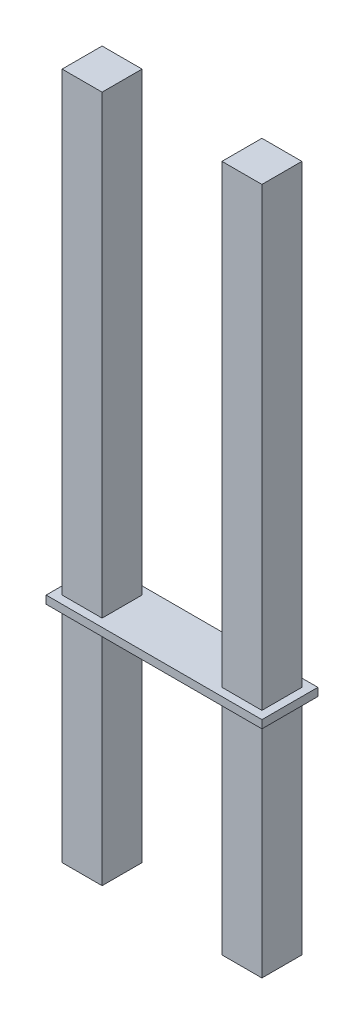
ISO-10303-21;
HEADER;
FILE_DESCRIPTION(('STEP AP214'),'2;1');
FILE_NAME('part.step','',(''),(''),'','','');
FILE_SCHEMA(('AUTOMOTIVE_DESIGN { 1 0 10303 214 1 1 1 1 }'));
ENDSEC;
DATA;
#1=APPLICATION_CONTEXT('core data for automotive mechanical design processes');
#2=APPLICATION_PROTOCOL_DEFINITION('international standard','automotive_design',2000,#1);
#3=PRODUCT_CONTEXT('',#1,'mechanical');
#4=PRODUCT('Part','Part','',(#3));
#5=PRODUCT_RELATED_PRODUCT_CATEGORY('part','',(#4));
#6=PRODUCT_DEFINITION_FORMATION('','',#4);
#7=PRODUCT_DEFINITION_CONTEXT('part definition',#1,'design');
#8=PRODUCT_DEFINITION('design','',#6,#7);
#9=PRODUCT_DEFINITION_SHAPE('','',#8);
#10=(LENGTH_UNIT() NAMED_UNIT(*) SI_UNIT(.MILLI.,.METRE.));
#11=(NAMED_UNIT(*) PLANE_ANGLE_UNIT() SI_UNIT($,.RADIAN.));
#12=(NAMED_UNIT(*) SI_UNIT($,.STERADIAN.) SOLID_ANGLE_UNIT());
#13=UNCERTAINTY_MEASURE_WITH_UNIT(LENGTH_MEASURE(1.E-05),#10,'distance_accuracy_value','');
#14=(GEOMETRIC_REPRESENTATION_CONTEXT(3) GLOBAL_UNCERTAINTY_ASSIGNED_CONTEXT((#13)) GLOBAL_UNIT_ASSIGNED_CONTEXT((#10,
#11,#12)) REPRESENTATION_CONTEXT('',''));
#15=CARTESIAN_POINT('',(0.,0.,0.));
#16=DIRECTION('',(0.,0.,1.));
#17=DIRECTION('',(1.,0.,0.));
#18=AXIS2_PLACEMENT_3D('',#15,#16,#17);
#19=CARTESIAN_POINT('',(0.,0.,-0.3175));
#20=DIRECTION('',(0.,0.,1.));
#21=DIRECTION('',(1.,0.,0.));
#22=AXIS2_PLACEMENT_3D('',#19,#20,#21);
#23=PLANE('',#22);
#24=DIRECTION('',(0.,-1.,0.));
#25=VECTOR('',#24,1.);
#26=CARTESIAN_POINT('',(0.9525,0.,-0.3175));
#27=LINE('',#26,#25);
#28=CARTESIAN_POINT('',(0.9525,3.556,-0.3175));
#29=VERTEX_POINT('',#28);
#30=CARTESIAN_POINT('',(0.9525,0.,-0.3175));
#31=VERTEX_POINT('',#30);
#32=EDGE_CURVE('E10',#29,#31,#27,.T.);
#33=ORIENTED_EDGE('',*,*,#32,.F.);
#34=DIRECTION('',(-1.,0.,0.));
#35=VECTOR('',#34,1.);
#36=CARTESIAN_POINT('',(0.,3.556,-0.3175));
#37=LINE('',#36,#35);
#38=CARTESIAN_POINT('',(1.5875,3.556,-0.3175));
#39=VERTEX_POINT('',#38);
#40=EDGE_CURVE('E24',#39,#29,#37,.T.);
#41=ORIENTED_EDGE('',*,*,#40,.F.);
#42=DIRECTION('',(0.,1.,0.));
#43=VECTOR('',#42,1.);
#44=CARTESIAN_POINT('',(1.5875,0.,-0.3175));
#45=LINE('',#44,#43);
#46=CARTESIAN_POINT('',(1.5875,0.,-0.3175));
#47=VERTEX_POINT('',#46);
#48=EDGE_CURVE('E421',#47,#39,#45,.T.);
#49=ORIENTED_EDGE('',*,*,#48,.F.);
#50=DIRECTION('',(1.,0.,0.));
#51=VECTOR('',#50,1.);
#52=CARTESIAN_POINT('',(-1.5875,0.,-0.3175));
#53=LINE('',#52,#51);
#54=EDGE_CURVE('E416',#31,#47,#53,.T.);
#55=ORIENTED_EDGE('',*,*,#54,.F.);
#56=EDGE_LOOP('',(#33,#41,#49,#55));
#57=FACE_BOUND('',#56,.T.);
#58=ADVANCED_FACE('F16',(#57),#23,.F.);
#59=CARTESIAN_POINT('',(-1.5875,0.,0.3175));
#60=DIRECTION('',(0.,1.,0.));
#61=DIRECTION('',(0.,0.,1.));
#62=AXIS2_PLACEMENT_3D('',#59,#60,#61);
#63=PLANE('',#62);
#64=DIRECTION('',(0.,0.,1.));
#65=VECTOR('',#64,1.);
#66=CARTESIAN_POINT('',(0.9525,0.,0.3175));
#67=LINE('',#66,#65);
#68=CARTESIAN_POINT('',(0.9525,0.,0.3175));
#69=VERTEX_POINT('',#68);
#70=EDGE_CURVE('E411',#31,#69,#67,.T.);
#71=ORIENTED_EDGE('',*,*,#70,.F.);
#72=ORIENTED_EDGE('',*,*,#54,.T.);
#73=DIRECTION('',(0.,0.,-1.));
#74=VECTOR('',#73,1.);
#75=CARTESIAN_POINT('',(1.5875,0.,0.3175));
#76=LINE('',#75,#74);
#77=CARTESIAN_POINT('',(1.5875,0.,0.3175));
#78=VERTEX_POINT('',#77);
#79=EDGE_CURVE('E406',#78,#47,#76,.T.);
#80=ORIENTED_EDGE('',*,*,#79,.F.);
#81=DIRECTION('',(1.,0.,0.));
#82=VECTOR('',#81,1.);
#83=CARTESIAN_POINT('',(-1.5875,0.,0.3175));
#84=LINE('',#83,#82);
#85=EDGE_CURVE('E401',#69,#78,#84,.T.);
#86=ORIENTED_EDGE('',*,*,#85,.F.);
#87=EDGE_LOOP('',(#71,#72,#80,#86));
#88=FACE_BOUND('',#87,.T.);
#89=ADVANCED_FACE('F445',(#88),#63,.F.);
#90=CARTESIAN_POINT('',(0.,0.,0.3175));
#91=DIRECTION('',(0.,0.,1.));
#92=DIRECTION('',(1.,0.,0.));
#93=AXIS2_PLACEMENT_3D('',#90,#91,#92);
#94=PLANE('',#93);
#95=DIRECTION('',(-1.,0.,0.));
#96=VECTOR('',#95,1.);
#97=CARTESIAN_POINT('',(0.,3.556,0.3175));
#98=LINE('',#97,#96);
#99=CARTESIAN_POINT('',(1.5875,3.556,0.3175));
#100=VERTEX_POINT('',#99);
#101=CARTESIAN_POINT('',(0.9525,3.556,0.3175));
#102=VERTEX_POINT('',#101);
#103=EDGE_CURVE('E397',#100,#102,#98,.T.);
#104=ORIENTED_EDGE('',*,*,#103,.T.);
#105=DIRECTION('',(0.,-1.,0.));
#106=VECTOR('',#105,1.);
#107=CARTESIAN_POINT('',(0.9525,0.,0.3175));
#108=LINE('',#107,#106);
#109=EDGE_CURVE('E392',#102,#69,#108,.T.);
#110=ORIENTED_EDGE('',*,*,#109,.T.);
#111=ORIENTED_EDGE('',*,*,#85,.T.);
#112=DIRECTION('',(0.,1.,0.));
#113=VECTOR('',#112,1.);
#114=CARTESIAN_POINT('',(1.5875,0.,0.3175));
#115=LINE('',#114,#113);
#116=EDGE_CURVE('E388',#78,#100,#115,.T.);
#117=ORIENTED_EDGE('',*,*,#116,.T.);
#118=EDGE_LOOP('',(#104,#110,#111,#117));
#119=FACE_BOUND('',#118,.T.);
#120=ADVANCED_FACE('F440',(#119),#94,.T.);
#121=CARTESIAN_POINT('',(1.5875,0.,0.3175));
#122=DIRECTION('',(-1.,0.,0.));
#123=DIRECTION('',(0.,0.,1.));
#124=AXIS2_PLACEMENT_3D('',#121,#122,#123);
#125=PLANE('',#124);
#126=DIRECTION('',(0.,0.,-1.));
#127=VECTOR('',#126,1.);
#128=CARTESIAN_POINT('',(1.5875,3.556,0.3175));
#129=LINE('',#128,#127);
#130=EDGE_CURVE('E383',#100,#39,#129,.T.);
#131=ORIENTED_EDGE('',*,*,#130,.F.);
#132=ORIENTED_EDGE('',*,*,#116,.F.);
#133=ORIENTED_EDGE('',*,*,#79,.T.);
#134=ORIENTED_EDGE('',*,*,#48,.T.);
#135=EDGE_LOOP('',(#131,#132,#133,#134));
#136=FACE_BOUND('',#135,.T.);
#137=ADVANCED_FACE('F443',(#136),#125,.F.);
#138=CARTESIAN_POINT('',(1.7145,3.556,0.4445));
#139=DIRECTION('',(0.,1.,0.));
#140=DIRECTION('',(0.,0.,1.));
#141=AXIS2_PLACEMENT_3D('',#138,#139,#140);
#142=PLANE('',#141);
#143=DIRECTION('',(-1.,0.,0.));
#144=VECTOR('',#143,1.);
#145=CARTESIAN_POINT('',(0.,3.556,0.3175));
#146=LINE('',#145,#144);
#147=CARTESIAN_POINT('',(-0.9525,3.556,0.3175));
#148=VERTEX_POINT('',#147);
#149=CARTESIAN_POINT('',(-1.5875,3.556,0.3175));
#150=VERTEX_POINT('',#149);
#151=EDGE_CURVE('E378',#148,#150,#146,.T.);
#152=ORIENTED_EDGE('',*,*,#151,.F.);
#153=DIRECTION('',(0.,0.,-1.));
#154=VECTOR('',#153,1.);
#155=CARTESIAN_POINT('',(-0.9525,3.556,2.54));
#156=LINE('',#155,#154);
#157=CARTESIAN_POINT('',(-0.9525,3.556,-0.3175));
#158=VERTEX_POINT('',#157);
#159=EDGE_CURVE('E374',#148,#158,#156,.T.);
#160=ORIENTED_EDGE('',*,*,#159,.T.);
#161=DIRECTION('',(-1.,0.,0.));
#162=VECTOR('',#161,1.);
#163=CARTESIAN_POINT('',(0.,3.556,-0.3175));
#164=LINE('',#163,#162);
#165=CARTESIAN_POINT('',(-1.5875,3.556,-0.3175));
#166=VERTEX_POINT('',#165);
#167=EDGE_CURVE('E170',#158,#166,#164,.T.);
#168=ORIENTED_EDGE('',*,*,#167,.T.);
#169=DIRECTION('',(0.,0.,1.));
#170=VECTOR('',#169,1.);
#171=CARTESIAN_POINT('',(-1.5875,3.556,0.3175));
#172=LINE('',#171,#170);
#173=EDGE_CURVE('E367',#166,#150,#172,.T.);
#174=ORIENTED_EDGE('',*,*,#173,.T.);
#175=EDGE_LOOP('',(#152,#160,#168,#174));
#176=FACE_BOUND('',#175,.T.);
#177=ORIENTED_EDGE('',*,*,#40,.T.);
#178=DIRECTION('',(0.,0.,-1.));
#179=VECTOR('',#178,1.);
#180=CARTESIAN_POINT('',(0.9525,3.556,2.54));
#181=LINE('',#180,#179);
#182=EDGE_CURVE('E362',#102,#29,#181,.T.);
#183=ORIENTED_EDGE('',*,*,#182,.F.);
#184=ORIENTED_EDGE('',*,*,#103,.F.);
#185=ORIENTED_EDGE('',*,*,#130,.T.);
#186=EDGE_LOOP('',(#177,#183,#184,#185));
#187=FACE_BOUND('',#186,.T.);
#188=DIRECTION('',(0.,0.,-1.));
#189=VECTOR('',#188,1.);
#190=CARTESIAN_POINT('',(-1.7145,3.556,0.4445));
#191=LINE('',#190,#189);
#192=CARTESIAN_POINT('',(-1.7145,3.556,0.4445));
#193=VERTEX_POINT('',#192);
#194=CARTESIAN_POINT('',(-1.7145,3.556,-0.4445));
#195=VERTEX_POINT('',#194);
#196=EDGE_CURVE('E358',#193,#195,#191,.T.);
#197=ORIENTED_EDGE('',*,*,#196,.T.);
#198=DIRECTION('',(-1.,0.,0.));
#199=VECTOR('',#198,1.);
#200=CARTESIAN_POINT('',(1.7145,3.556,-0.4445));
#201=LINE('',#200,#199);
#202=CARTESIAN_POINT('',(1.7145,3.556,-0.4445));
#203=VERTEX_POINT('',#202);
#204=EDGE_CURVE('E353',#203,#195,#201,.T.);
#205=ORIENTED_EDGE('',*,*,#204,.F.);
#206=DIRECTION('',(0.,0.,-1.));
#207=VECTOR('',#206,1.);
#208=CARTESIAN_POINT('',(1.7145,3.556,0.4445));
#209=LINE('',#208,#207);
#210=CARTESIAN_POINT('',(1.7145,3.556,0.4445));
#211=VERTEX_POINT('',#210);
#212=EDGE_CURVE('E348',#211,#203,#209,.T.);
#213=ORIENTED_EDGE('',*,*,#212,.F.);
#214=DIRECTION('',(-1.,0.,0.));
#215=VECTOR('',#214,1.);
#216=CARTESIAN_POINT('',(1.7145,3.556,0.4445));
#217=LINE('',#216,#215);
#218=EDGE_CURVE('E344',#211,#193,#217,.T.);
#219=ORIENTED_EDGE('',*,*,#218,.T.);
#220=EDGE_LOOP('',(#197,#205,#213,#219));
#221=FACE_BOUND('',#220,.T.);
#222=ADVANCED_FACE('F431',(#176,#187,#221),#142,.F.);
#223=CARTESIAN_POINT('',(1.7145,3.683,0.4445));
#224=DIRECTION('',(0.,0.,-1.));
#225=DIRECTION('',(-1.,0.,0.));
#226=AXIS2_PLACEMENT_3D('',#223,#224,#225);
#227=PLANE('',#226);
#228=DIRECTION('',(0.,-1.,0.));
#229=VECTOR('',#228,1.);
#230=CARTESIAN_POINT('',(-1.7145,3.683,0.4445));
#231=LINE('',#230,#229);
#232=CARTESIAN_POINT('',(-1.7145,3.683,0.4445));
#233=VERTEX_POINT('',#232);
#234=EDGE_CURVE('E339',#233,#193,#231,.T.);
#235=ORIENTED_EDGE('',*,*,#234,.T.);
#236=ORIENTED_EDGE('',*,*,#218,.F.);
#237=DIRECTION('',(0.,-1.,0.));
#238=VECTOR('',#237,1.);
#239=CARTESIAN_POINT('',(1.7145,3.683,0.4445));
#240=LINE('',#239,#238);
#241=CARTESIAN_POINT('',(1.7145,3.683,0.4445));
#242=VERTEX_POINT('',#241);
#243=EDGE_CURVE('E334',#242,#211,#240,.T.);
#244=ORIENTED_EDGE('',*,*,#243,.F.);
#245=DIRECTION('',(-1.,0.,0.));
#246=VECTOR('',#245,1.);
#247=CARTESIAN_POINT('',(1.7145,3.683,0.4445));
#248=LINE('',#247,#246);
#249=EDGE_CURVE('E330',#242,#233,#248,.T.);
#250=ORIENTED_EDGE('',*,*,#249,.T.);
#251=EDGE_LOOP('',(#235,#236,#244,#250));
#252=FACE_BOUND('',#251,.T.);
#253=ADVANCED_FACE('F458',(#252),#227,.F.);
#254=CARTESIAN_POINT('',(1.7145,3.683,-0.4445));
#255=DIRECTION('',(0.,-1.,0.));
#256=DIRECTION('',(0.,0.,-1.));
#257=AXIS2_PLACEMENT_3D('',#254,#255,#256);
#258=PLANE('',#257);
#259=DIRECTION('',(0.,0.,-1.));
#260=VECTOR('',#259,1.);
#261=CARTESIAN_POINT('',(-0.9525,3.683,2.54));
#262=LINE('',#261,#260);
#263=CARTESIAN_POINT('',(-0.9525,3.683,0.3175));
#264=VERTEX_POINT('',#263);
#265=CARTESIAN_POINT('',(-0.9525,3.683,-0.3175));
#266=VERTEX_POINT('',#265);
#267=EDGE_CURVE('E325',#264,#266,#262,.T.);
#268=ORIENTED_EDGE('',*,*,#267,.F.);
#269=DIRECTION('',(1.,0.,0.));
#270=VECTOR('',#269,1.);
#271=CARTESIAN_POINT('',(0.,3.683,0.3175));
#272=LINE('',#271,#270);
#273=CARTESIAN_POINT('',(-1.5875,3.683,0.3175));
#274=VERTEX_POINT('',#273);
#275=EDGE_CURVE('E320',#274,#264,#272,.T.);
#276=ORIENTED_EDGE('',*,*,#275,.F.);
#277=DIRECTION('',(0.,0.,-1.));
#278=VECTOR('',#277,1.);
#279=CARTESIAN_POINT('',(-1.5875,3.683,0.3175));
#280=LINE('',#279,#278);
#281=CARTESIAN_POINT('',(-1.5875,3.683,-0.3175));
#282=VERTEX_POINT('',#281);
#283=EDGE_CURVE('E316',#274,#282,#280,.T.);
#284=ORIENTED_EDGE('',*,*,#283,.T.);
#285=DIRECTION('',(1.,0.,0.));
#286=VECTOR('',#285,1.);
#287=CARTESIAN_POINT('',(0.,3.683,-0.3175));
#288=LINE('',#287,#286);
#289=EDGE_CURVE('E312',#282,#266,#288,.T.);
#290=ORIENTED_EDGE('',*,*,#289,.T.);
#291=EDGE_LOOP('',(#268,#276,#284,#290));
#292=FACE_BOUND('',#291,.T.);
#293=DIRECTION('',(1.,0.,0.));
#294=VECTOR('',#293,1.);
#295=CARTESIAN_POINT('',(0.,3.683,0.3175));
#296=LINE('',#295,#294);
#297=CARTESIAN_POINT('',(0.9525,3.683,0.3175));
#298=VERTEX_POINT('',#297);
#299=CARTESIAN_POINT('',(1.5875,3.683,0.3175));
#300=VERTEX_POINT('',#299);
#301=EDGE_CURVE('E307',#298,#300,#296,.T.);
#302=ORIENTED_EDGE('',*,*,#301,.F.);
#303=DIRECTION('',(0.,0.,-1.));
#304=VECTOR('',#303,1.);
#305=CARTESIAN_POINT('',(0.9525,3.683,2.54));
#306=LINE('',#305,#304);
#307=CARTESIAN_POINT('',(0.9525,3.683,-0.3175));
#308=VERTEX_POINT('',#307);
#309=EDGE_CURVE('E303',#298,#308,#306,.T.);
#310=ORIENTED_EDGE('',*,*,#309,.T.);
#311=DIRECTION('',(1.,0.,0.));
#312=VECTOR('',#311,1.);
#313=CARTESIAN_POINT('',(0.,3.683,-0.3175));
#314=LINE('',#313,#312);
#315=CARTESIAN_POINT('',(1.5875,3.683,-0.3175));
#316=VERTEX_POINT('',#315);
#317=EDGE_CURVE('E299',#308,#316,#314,.T.);
#318=ORIENTED_EDGE('',*,*,#317,.T.);
#319=DIRECTION('',(0.,0.,1.));
#320=VECTOR('',#319,1.);
#321=CARTESIAN_POINT('',(1.5875,3.683,0.3175));
#322=LINE('',#321,#320);
#323=EDGE_CURVE('E295',#316,#300,#322,.T.);
#324=ORIENTED_EDGE('',*,*,#323,.T.);
#325=EDGE_LOOP('',(#302,#310,#318,#324));
#326=FACE_BOUND('',#325,.T.);
#327=DIRECTION('',(-1.,0.,0.));
#328=VECTOR('',#327,1.);
#329=CARTESIAN_POINT('',(1.7145,3.683,-0.4445));
#330=LINE('',#329,#328);
#331=CARTESIAN_POINT('',(1.7145,3.683,-0.4445));
#332=VERTEX_POINT('',#331);
#333=CARTESIAN_POINT('',(-1.7145,3.683,-0.4445));
#334=VERTEX_POINT('',#333);
#335=EDGE_CURVE('E291',#332,#334,#330,.T.);
#336=ORIENTED_EDGE('',*,*,#335,.T.);
#337=DIRECTION('',(0.,0.,1.));
#338=VECTOR('',#337,1.);
#339=CARTESIAN_POINT('',(-1.7145,3.683,-0.4445));
#340=LINE('',#339,#338);
#341=EDGE_CURVE('E286',#334,#233,#340,.T.);
#342=ORIENTED_EDGE('',*,*,#341,.T.);
#343=ORIENTED_EDGE('',*,*,#249,.F.);
#344=DIRECTION('',(0.,0.,1.));
#345=VECTOR('',#344,1.);
#346=CARTESIAN_POINT('',(1.7145,3.683,-0.4445));
#347=LINE('',#346,#345);
#348=EDGE_CURVE('E281',#332,#242,#347,.T.);
#349=ORIENTED_EDGE('',*,*,#348,.F.);
#350=EDGE_LOOP('',(#336,#342,#343,#349));
#351=FACE_BOUND('',#350,.T.);
#352=ADVANCED_FACE('F462',(#292,#326,#351),#258,.F.);
#353=CARTESIAN_POINT('',(1.7145,0.,0.));
#354=DIRECTION('',(1.,0.,0.));
#355=DIRECTION('',(0.,0.,-1.));
#356=AXIS2_PLACEMENT_3D('',#353,#354,#355);
#357=PLANE('',#356);
#358=ORIENTED_EDGE('',*,*,#348,.T.);
#359=ORIENTED_EDGE('',*,*,#243,.T.);
#360=ORIENTED_EDGE('',*,*,#212,.T.);
#361=DIRECTION('',(0.,1.,0.));
#362=VECTOR('',#361,1.);
#363=CARTESIAN_POINT('',(1.7145,3.556,-0.4445));
#364=LINE('',#363,#362);
#365=EDGE_CURVE('E276',#203,#332,#364,.T.);
#366=ORIENTED_EDGE('',*,*,#365,.T.);
#367=EDGE_LOOP('',(#358,#359,#360,#366));
#368=FACE_BOUND('',#367,.T.);
#369=ADVANCED_FACE('F466',(#368),#357,.T.);
#370=CARTESIAN_POINT('',(1.7145,3.556,-0.4445));
#371=DIRECTION('',(0.,0.,1.));
#372=DIRECTION('',(1.,0.,0.));
#373=AXIS2_PLACEMENT_3D('',#370,#371,#372);
#374=PLANE('',#373);
#375=DIRECTION('',(0.,1.,0.));
#376=VECTOR('',#375,1.);
#377=CARTESIAN_POINT('',(-1.7145,3.556,-0.4445));
#378=LINE('',#377,#376);
#379=EDGE_CURVE('E271',#195,#334,#378,.T.);
#380=ORIENTED_EDGE('',*,*,#379,.T.);
#381=ORIENTED_EDGE('',*,*,#335,.F.);
#382=ORIENTED_EDGE('',*,*,#365,.F.);
#383=ORIENTED_EDGE('',*,*,#204,.T.);
#384=EDGE_LOOP('',(#380,#381,#382,#383));
#385=FACE_BOUND('',#384,.T.);
#386=ADVANCED_FACE('F470',(#385),#374,.F.);
#387=CARTESIAN_POINT('',(-1.7145,0.,0.));
#388=DIRECTION('',(1.,0.,0.));
#389=DIRECTION('',(0.,0.,-1.));
#390=AXIS2_PLACEMENT_3D('',#387,#388,#389);
#391=PLANE('',#390);
#392=ORIENTED_EDGE('',*,*,#341,.F.);
#393=ORIENTED_EDGE('',*,*,#379,.F.);
#394=ORIENTED_EDGE('',*,*,#196,.F.);
#395=ORIENTED_EDGE('',*,*,#234,.F.);
#396=EDGE_LOOP('',(#392,#393,#394,#395));
#397=FACE_BOUND('',#396,.T.);
#398=ADVANCED_FACE('F474',(#397),#391,.F.);
#399=CARTESIAN_POINT('',(1.5875,0.,0.3175));
#400=DIRECTION('',(-1.,0.,0.));
#401=DIRECTION('',(0.,0.,1.));
#402=AXIS2_PLACEMENT_3D('',#399,#400,#401);
#403=PLANE('',#402);
#404=ORIENTED_EDGE('',*,*,#323,.F.);
#405=DIRECTION('',(0.,1.,0.));
#406=VECTOR('',#405,1.);
#407=CARTESIAN_POINT('',(1.5875,0.,-0.3175));
#408=LINE('',#407,#406);
#409=CARTESIAN_POINT('',(1.5875,10.922,-0.3175));
#410=VERTEX_POINT('',#409);
#411=EDGE_CURVE('E267',#316,#410,#408,.T.);
#412=ORIENTED_EDGE('',*,*,#411,.T.);
#413=DIRECTION('',(0.,0.,-1.));
#414=VECTOR('',#413,1.);
#415=CARTESIAN_POINT('',(1.5875,10.922,0.3175));
#416=LINE('',#415,#414);
#417=CARTESIAN_POINT('',(1.5875,10.922,0.3175));
#418=VERTEX_POINT('',#417);
#419=EDGE_CURVE('E262',#418,#410,#416,.T.);
#420=ORIENTED_EDGE('',*,*,#419,.F.);
#421=DIRECTION('',(0.,1.,0.));
#422=VECTOR('',#421,1.);
#423=CARTESIAN_POINT('',(1.5875,0.,0.3175));
#424=LINE('',#423,#422);
#425=EDGE_CURVE('E257',#300,#418,#424,.T.);
#426=ORIENTED_EDGE('',*,*,#425,.F.);
#427=EDGE_LOOP('',(#404,#412,#420,#426));
#428=FACE_BOUND('',#427,.T.);
#429=ADVANCED_FACE('F478',(#428),#403,.F.);
#430=CARTESIAN_POINT('',(0.,0.,0.3175));
#431=DIRECTION('',(0.,0.,1.));
#432=DIRECTION('',(1.,0.,0.));
#433=AXIS2_PLACEMENT_3D('',#430,#431,#432);
#434=PLANE('',#433);
#435=DIRECTION('',(-1.,0.,0.));
#436=VECTOR('',#435,1.);
#437=CARTESIAN_POINT('',(1.5875,10.922,0.3175));
#438=LINE('',#437,#436);
#439=CARTESIAN_POINT('',(0.9525,10.922,0.3175));
#440=VERTEX_POINT('',#439);
#441=EDGE_CURVE('E253',#418,#440,#438,.T.);
#442=ORIENTED_EDGE('',*,*,#441,.T.);
#443=DIRECTION('',(0.,-1.,0.));
#444=VECTOR('',#443,1.);
#445=CARTESIAN_POINT('',(0.9525,0.,0.3175));
#446=LINE('',#445,#444);
#447=EDGE_CURVE('E248',#440,#298,#446,.T.);
#448=ORIENTED_EDGE('',*,*,#447,.T.);
#449=ORIENTED_EDGE('',*,*,#301,.T.);
#450=ORIENTED_EDGE('',*,*,#425,.T.);
#451=EDGE_LOOP('',(#442,#448,#449,#450));
#452=FACE_BOUND('',#451,.T.);
#453=ADVANCED_FACE('F482',(#452),#434,.T.);
#454=CARTESIAN_POINT('',(0.9525,3.683,2.54));
#455=DIRECTION('',(-1.,0.,0.));
#456=DIRECTION('',(0.,0.,1.));
#457=AXIS2_PLACEMENT_3D('',#454,#455,#456);
#458=PLANE('',#457);
#459=DIRECTION('',(0.,0.,-1.));
#460=VECTOR('',#459,1.);
#461=CARTESIAN_POINT('',(0.9525,10.922,0.3175));
#462=LINE('',#461,#460);
#463=CARTESIAN_POINT('',(0.9525,10.922,-0.3175));
#464=VERTEX_POINT('',#463);
#465=EDGE_CURVE('E244',#440,#464,#462,.T.);
#466=ORIENTED_EDGE('',*,*,#465,.T.);
#467=DIRECTION('',(0.,-1.,0.));
#468=VECTOR('',#467,1.);
#469=CARTESIAN_POINT('',(0.9525,0.,-0.3175));
#470=LINE('',#469,#468);
#471=EDGE_CURVE('E239',#464,#308,#470,.T.);
#472=ORIENTED_EDGE('',*,*,#471,.T.);
#473=ORIENTED_EDGE('',*,*,#309,.F.);
#474=ORIENTED_EDGE('',*,*,#447,.F.);
#475=EDGE_LOOP('',(#466,#472,#473,#474));
#476=FACE_BOUND('',#475,.T.);
#477=ADVANCED_FACE('F486',(#476),#458,.T.);
#478=CARTESIAN_POINT('',(0.,0.,-0.3175));
#479=DIRECTION('',(0.,0.,1.));
#480=DIRECTION('',(1.,0.,0.));
#481=AXIS2_PLACEMENT_3D('',#478,#479,#480);
#482=PLANE('',#481);
#483=ORIENTED_EDGE('',*,*,#471,.F.);
#484=DIRECTION('',(-1.,0.,0.));
#485=VECTOR('',#484,1.);
#486=CARTESIAN_POINT('',(1.5875,10.922,-0.3175));
#487=LINE('',#486,#485);
#488=EDGE_CURVE('E234',#410,#464,#487,.T.);
#489=ORIENTED_EDGE('',*,*,#488,.F.);
#490=ORIENTED_EDGE('',*,*,#411,.F.);
#491=ORIENTED_EDGE('',*,*,#317,.F.);
#492=EDGE_LOOP('',(#483,#489,#490,#491));
#493=FACE_BOUND('',#492,.T.);
#494=ADVANCED_FACE('F490',(#493),#482,.F.);
#495=CARTESIAN_POINT('',(1.5875,10.922,0.3175));
#496=DIRECTION('',(0.,-1.,0.));
#497=DIRECTION('',(0.,0.,-1.));
#498=AXIS2_PLACEMENT_3D('',#495,#496,#497);
#499=PLANE('',#498);
#500=ORIENTED_EDGE('',*,*,#465,.F.);
#501=ORIENTED_EDGE('',*,*,#441,.F.);
#502=ORIENTED_EDGE('',*,*,#419,.T.);
#503=ORIENTED_EDGE('',*,*,#488,.T.);
#504=EDGE_LOOP('',(#500,#501,#502,#503));
#505=FACE_BOUND('',#504,.T.);
#506=ADVANCED_FACE('F494',(#505),#499,.F.);
#507=CARTESIAN_POINT('',(0.,0.,-0.3175));
#508=DIRECTION('',(0.,0.,1.));
#509=DIRECTION('',(1.,0.,0.));
#510=AXIS2_PLACEMENT_3D('',#507,#508,#509);
#511=PLANE('',#510);
#512=DIRECTION('',(0.,1.,0.));
#513=VECTOR('',#512,1.);
#514=CARTESIAN_POINT('',(-0.9525,0.,-0.3175));
#515=LINE('',#514,#513);
#516=CARTESIAN_POINT('',(-0.9525,10.922,-0.3175));
#517=VERTEX_POINT('',#516);
#518=EDGE_CURVE('E229',#266,#517,#515,.T.);
#519=ORIENTED_EDGE('',*,*,#518,.F.);
#520=ORIENTED_EDGE('',*,*,#289,.F.);
#521=DIRECTION('',(0.,-1.,0.));
#522=VECTOR('',#521,1.);
#523=CARTESIAN_POINT('',(-1.5875,10.922,-0.3175));
#524=LINE('',#523,#522);
#525=CARTESIAN_POINT('',(-1.5875,10.922,-0.3175));
#526=VERTEX_POINT('',#525);
#527=EDGE_CURVE('E224',#526,#282,#524,.T.);
#528=ORIENTED_EDGE('',*,*,#527,.F.);
#529=DIRECTION('',(-1.,0.,0.));
#530=VECTOR('',#529,1.);
#531=CARTESIAN_POINT('',(1.5875,10.922,-0.3175));
#532=LINE('',#531,#530);
#533=EDGE_CURVE('E219',#517,#526,#532,.T.);
#534=ORIENTED_EDGE('',*,*,#533,.F.);
#535=EDGE_LOOP('',(#519,#520,#528,#534));
#536=FACE_BOUND('',#535,.T.);
#537=ADVANCED_FACE('F498',(#536),#511,.F.);
#538=CARTESIAN_POINT('',(1.5875,10.922,0.3175));
#539=DIRECTION('',(0.,-1.,0.));
#540=DIRECTION('',(0.,0.,-1.));
#541=AXIS2_PLACEMENT_3D('',#538,#539,#540);
#542=PLANE('',#541);
#543=DIRECTION('',(0.,0.,1.));
#544=VECTOR('',#543,1.);
#545=CARTESIAN_POINT('',(-0.9525,10.922,0.3175));
#546=LINE('',#545,#544);
#547=CARTESIAN_POINT('',(-0.9525,10.922,0.3175));
#548=VERTEX_POINT('',#547);
#549=EDGE_CURVE('E214',#517,#548,#546,.T.);
#550=ORIENTED_EDGE('',*,*,#549,.F.);
#551=ORIENTED_EDGE('',*,*,#533,.T.);
#552=DIRECTION('',(0.,0.,-1.));
#553=VECTOR('',#552,1.);
#554=CARTESIAN_POINT('',(-1.5875,10.922,0.3175));
#555=LINE('',#554,#553);
#556=CARTESIAN_POINT('',(-1.5875,10.922,0.3175));
#557=VERTEX_POINT('',#556);
#558=EDGE_CURVE('E209',#557,#526,#555,.T.);
#559=ORIENTED_EDGE('',*,*,#558,.F.);
#560=DIRECTION('',(-1.,0.,0.));
#561=VECTOR('',#560,1.);
#562=CARTESIAN_POINT('',(1.5875,10.922,0.3175));
#563=LINE('',#562,#561);
#564=EDGE_CURVE('E204',#548,#557,#563,.T.);
#565=ORIENTED_EDGE('',*,*,#564,.F.);
#566=EDGE_LOOP('',(#550,#551,#559,#565));
#567=FACE_BOUND('',#566,.T.);
#568=ADVANCED_FACE('F502',(#567),#542,.F.);
#569=CARTESIAN_POINT('',(0.,0.,0.3175));
#570=DIRECTION('',(0.,0.,1.));
#571=DIRECTION('',(1.,0.,0.));
#572=AXIS2_PLACEMENT_3D('',#569,#570,#571);
#573=PLANE('',#572);
#574=ORIENTED_EDGE('',*,*,#275,.T.);
#575=DIRECTION('',(0.,1.,0.));
#576=VECTOR('',#575,1.);
#577=CARTESIAN_POINT('',(-0.9525,0.,0.3175));
#578=LINE('',#577,#576);
#579=EDGE_CURVE('E199',#264,#548,#578,.T.);
#580=ORIENTED_EDGE('',*,*,#579,.T.);
#581=ORIENTED_EDGE('',*,*,#564,.T.);
#582=DIRECTION('',(0.,-1.,0.));
#583=VECTOR('',#582,1.);
#584=CARTESIAN_POINT('',(-1.5875,10.922,0.3175));
#585=LINE('',#584,#583);
#586=EDGE_CURVE('E194',#557,#274,#585,.T.);
#587=ORIENTED_EDGE('',*,*,#586,.T.);
#588=EDGE_LOOP('',(#574,#580,#581,#587));
#589=FACE_BOUND('',#588,.T.);
#590=ADVANCED_FACE('F506',(#589),#573,.T.);
#591=CARTESIAN_POINT('',(-1.5875,10.922,0.3175));
#592=DIRECTION('',(1.,0.,0.));
#593=DIRECTION('',(0.,0.,-1.));
#594=AXIS2_PLACEMENT_3D('',#591,#592,#593);
#595=PLANE('',#594);
#596=ORIENTED_EDGE('',*,*,#283,.F.);
#597=ORIENTED_EDGE('',*,*,#586,.F.);
#598=ORIENTED_EDGE('',*,*,#558,.T.);
#599=ORIENTED_EDGE('',*,*,#527,.T.);
#600=EDGE_LOOP('',(#596,#597,#598,#599));
#601=FACE_BOUND('',#600,.T.);
#602=ADVANCED_FACE('F510',(#601),#595,.F.);
#603=CARTESIAN_POINT('',(-0.9525,14.605,2.54));
#604=DIRECTION('',(1.,0.,0.));
#605=DIRECTION('',(0.,0.,-1.));
#606=AXIS2_PLACEMENT_3D('',#603,#604,#605);
#607=PLANE('',#606);
#608=ORIENTED_EDGE('',*,*,#267,.T.);
#609=ORIENTED_EDGE('',*,*,#518,.T.);
#610=ORIENTED_EDGE('',*,*,#549,.T.);
#611=ORIENTED_EDGE('',*,*,#579,.F.);
#612=EDGE_LOOP('',(#608,#609,#610,#611));
#613=FACE_BOUND('',#612,.T.);
#614=ADVANCED_FACE('F514',(#613),#607,.T.);
#615=CARTESIAN_POINT('',(0.9525,-7.366,2.54));
#616=DIRECTION('',(-1.,0.,0.));
#617=DIRECTION('',(0.,0.,1.));
#618=AXIS2_PLACEMENT_3D('',#615,#616,#617);
#619=PLANE('',#618);
#620=ORIENTED_EDGE('',*,*,#32,.T.);
#621=ORIENTED_EDGE('',*,*,#70,.T.);
#622=ORIENTED_EDGE('',*,*,#109,.F.);
#623=ORIENTED_EDGE('',*,*,#182,.T.);
#624=EDGE_LOOP('',(#620,#621,#622,#623));
#625=FACE_BOUND('',#624,.T.);
#626=ADVANCED_FACE('F437',(#625),#619,.T.);
#627=CARTESIAN_POINT('',(-1.5875,10.922,0.3175));
#628=DIRECTION('',(1.,0.,0.));
#629=DIRECTION('',(0.,0.,-1.));
#630=AXIS2_PLACEMENT_3D('',#627,#628,#629);
#631=PLANE('',#630);
#632=ORIENTED_EDGE('',*,*,#173,.F.);
#633=DIRECTION('',(0.,-1.,0.));
#634=VECTOR('',#633,1.);
#635=CARTESIAN_POINT('',(-1.5875,10.922,-0.3175));
#636=LINE('',#635,#634);
#637=CARTESIAN_POINT('',(-1.5875,0.,-0.3175));
#638=VERTEX_POINT('',#637);
#639=EDGE_CURVE('E190',#166,#638,#636,.T.);
#640=ORIENTED_EDGE('',*,*,#639,.T.);
#641=DIRECTION('',(0.,0.,-1.));
#642=VECTOR('',#641,1.);
#643=CARTESIAN_POINT('',(-1.5875,0.,0.3175));
#644=LINE('',#643,#642);
#645=CARTESIAN_POINT('',(-1.5875,0.,0.3175));
#646=VERTEX_POINT('',#645);
#647=EDGE_CURVE('E165',#646,#638,#644,.T.);
#648=ORIENTED_EDGE('',*,*,#647,.F.);
#649=DIRECTION('',(0.,-1.,0.));
#650=VECTOR('',#649,1.);
#651=CARTESIAN_POINT('',(-1.5875,10.922,0.3175));
#652=LINE('',#651,#650);
#653=EDGE_CURVE('E182',#150,#646,#652,.T.);
#654=ORIENTED_EDGE('',*,*,#653,.F.);
#655=EDGE_LOOP('',(#632,#640,#648,#654));
#656=FACE_BOUND('',#655,.T.);
#657=ADVANCED_FACE('F521',(#656),#631,.F.);
#658=CARTESIAN_POINT('',(0.,0.,0.3175));
#659=DIRECTION('',(0.,0.,1.));
#660=DIRECTION('',(1.,0.,0.));
#661=AXIS2_PLACEMENT_3D('',#658,#659,#660);
#662=PLANE('',#661);
#663=DIRECTION('',(1.,0.,0.));
#664=VECTOR('',#663,1.);
#665=CARTESIAN_POINT('',(-1.5875,0.,0.3175));
#666=LINE('',#665,#664);
#667=CARTESIAN_POINT('',(-0.9525,0.,0.3175));
#668=VERTEX_POINT('',#667);
#669=EDGE_CURVE('E172',#646,#668,#666,.T.);
#670=ORIENTED_EDGE('',*,*,#669,.T.);
#671=DIRECTION('',(0.,1.,0.));
#672=VECTOR('',#671,1.);
#673=CARTESIAN_POINT('',(-0.9525,0.,0.3175));
#674=LINE('',#673,#672);
#675=EDGE_CURVE('E157',#668,#148,#674,.T.);
#676=ORIENTED_EDGE('',*,*,#675,.T.);
#677=ORIENTED_EDGE('',*,*,#151,.T.);
#678=ORIENTED_EDGE('',*,*,#653,.T.);
#679=EDGE_LOOP('',(#670,#676,#677,#678));
#680=FACE_BOUND('',#679,.T.);
#681=ADVANCED_FACE('F524',(#680),#662,.T.);
#682=CARTESIAN_POINT('',(-0.9525,3.556,2.54));
#683=DIRECTION('',(1.,0.,0.));
#684=DIRECTION('',(0.,0.,-1.));
#685=AXIS2_PLACEMENT_3D('',#682,#683,#684);
#686=PLANE('',#685);
#687=DIRECTION('',(0.,1.,0.));
#688=VECTOR('',#687,1.);
#689=CARTESIAN_POINT('',(-0.9525,0.,-0.3175));
#690=LINE('',#689,#688);
#691=CARTESIAN_POINT('',(-0.9525,0.,-0.3175));
#692=VERTEX_POINT('',#691);
#693=EDGE_CURVE('E154',#692,#158,#690,.T.);
#694=ORIENTED_EDGE('',*,*,#693,.T.);
#695=ORIENTED_EDGE('',*,*,#159,.F.);
#696=ORIENTED_EDGE('',*,*,#675,.F.);
#697=DIRECTION('',(0.,0.,-1.));
#698=VECTOR('',#697,1.);
#699=CARTESIAN_POINT('',(-0.9525,0.,0.3175));
#700=LINE('',#699,#698);
#701=EDGE_CURVE('E149',#668,#692,#700,.T.);
#702=ORIENTED_EDGE('',*,*,#701,.T.);
#703=EDGE_LOOP('',(#694,#695,#696,#702));
#704=FACE_BOUND('',#703,.T.);
#705=ADVANCED_FACE('F151',(#704),#686,.T.);
#706=CARTESIAN_POINT('',(-1.5875,0.,0.3175));
#707=DIRECTION('',(0.,1.,0.));
#708=DIRECTION('',(0.,0.,1.));
#709=AXIS2_PLACEMENT_3D('',#706,#707,#708);
#710=PLANE('',#709);
#711=ORIENTED_EDGE('',*,*,#701,.F.);
#712=ORIENTED_EDGE('',*,*,#669,.F.);
#713=ORIENTED_EDGE('',*,*,#647,.T.);
#714=DIRECTION('',(1.,0.,0.));
#715=VECTOR('',#714,1.);
#716=CARTESIAN_POINT('',(-1.5875,0.,-0.3175));
#717=LINE('',#716,#715);
#718=EDGE_CURVE('E160',#638,#692,#717,.T.);
#719=ORIENTED_EDGE('',*,*,#718,.T.);
#720=EDGE_LOOP('',(#711,#712,#713,#719));
#721=FACE_BOUND('',#720,.T.);
#722=ADVANCED_FACE('F164',(#721),#710,.F.);
#723=CARTESIAN_POINT('',(0.,0.,-0.3175));
#724=DIRECTION('',(0.,0.,1.));
#725=DIRECTION('',(1.,0.,0.));
#726=AXIS2_PLACEMENT_3D('',#723,#724,#725);
#727=PLANE('',#726);
#728=ORIENTED_EDGE('',*,*,#693,.F.);
#729=ORIENTED_EDGE('',*,*,#718,.F.);
#730=ORIENTED_EDGE('',*,*,#639,.F.);
#731=ORIENTED_EDGE('',*,*,#167,.F.);
#732=EDGE_LOOP('',(#728,#729,#730,#731));
#733=FACE_BOUND('',#732,.T.);
#734=ADVANCED_FACE('F169',(#733),#727,.F.);
#735=CLOSED_SHELL('',(#58,#89,#120,#137,#222,#253,#352,#369,#386,#398,#429,#453,#477,#494,#506,
#537,#568,#590,#602,#614,#626,#657,#681,#705,#722,#734));
#736=MANIFOLD_SOLID_BREP('B1',#735);
#737=ADVANCED_BREP_SHAPE_REPRESENTATION('',(#18,#736),#14);
#738=SHAPE_DEFINITION_REPRESENTATION(#9,#737);
ENDSEC;
END-ISO-10303-21;
